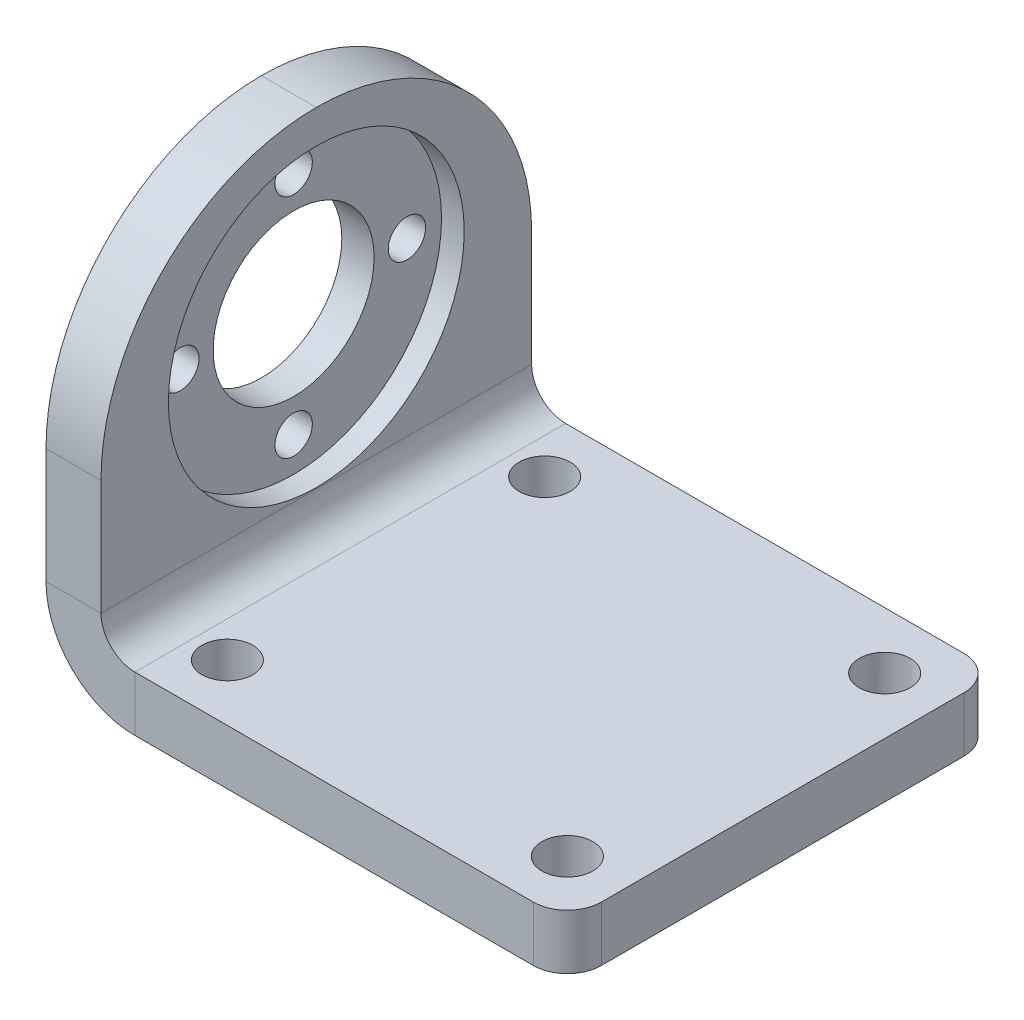
ISO-10303-21;
HEADER;
FILE_DESCRIPTION(('STEP AP214'),'2;1');
FILE_NAME('part.step','',(''),(''),'','','');
FILE_SCHEMA(('AUTOMOTIVE_DESIGN { 1 0 10303 214 1 1 1 1 }'));
ENDSEC;
DATA;
#1=APPLICATION_CONTEXT('core data for automotive mechanical design processes');
#2=APPLICATION_PROTOCOL_DEFINITION('international standard','automotive_design',2000,#1);
#3=PRODUCT_CONTEXT('',#1,'mechanical');
#4=PRODUCT('Part','Part','',(#3));
#5=PRODUCT_RELATED_PRODUCT_CATEGORY('part','',(#4));
#6=PRODUCT_DEFINITION_FORMATION('','',#4);
#7=PRODUCT_DEFINITION_CONTEXT('part definition',#1,'design');
#8=PRODUCT_DEFINITION('design','',#6,#7);
#9=PRODUCT_DEFINITION_SHAPE('','',#8);
#10=(LENGTH_UNIT() NAMED_UNIT(*) SI_UNIT(.MILLI.,.METRE.));
#11=(NAMED_UNIT(*) PLANE_ANGLE_UNIT() SI_UNIT($,.RADIAN.));
#12=(NAMED_UNIT(*) SI_UNIT($,.STERADIAN.) SOLID_ANGLE_UNIT());
#13=UNCERTAINTY_MEASURE_WITH_UNIT(LENGTH_MEASURE(1.E-05),#10,'distance_accuracy_value','');
#14=(GEOMETRIC_REPRESENTATION_CONTEXT(3) GLOBAL_UNCERTAINTY_ASSIGNED_CONTEXT((#13)) GLOBAL_UNIT_ASSIGNED_CONTEXT((#10,
#11,#12)) REPRESENTATION_CONTEXT('',''));
#15=CARTESIAN_POINT('',(0.,0.,0.));
#16=DIRECTION('',(0.,0.,1.));
#17=DIRECTION('',(1.,0.,0.));
#18=AXIS2_PLACEMENT_3D('',#15,#16,#17);
#19=CARTESIAN_POINT('',(0.,21.,19.));
#20=DIRECTION('',(1.,0.,0.));
#21=DIRECTION('',(0.,0.,-1.));
#22=AXIS2_PLACEMENT_3D('',#19,#20,#21);
#23=CYLINDRICAL_SURFACE('',#22,7.1);
#24=CARTESIAN_POINT('',(0.,21.,19.));
#25=DIRECTION('',(1.,0.,0.));
#26=DIRECTION('',(0.,0.,-1.));
#27=AXIS2_PLACEMENT_3D('',#24,#25,#26);
#28=CIRCLE('',#27,7.1);
#29=CARTESIAN_POINT('',(0.,21.,11.9));
#30=VERTEX_POINT('',#29);
#31=EDGE_CURVE('E174',#30,#30,#28,.T.);
#32=ORIENTED_EDGE('',*,*,#31,.F.);
#33=EDGE_LOOP('',(#32));
#34=FACE_BOUND('',#33,.T.);
#35=CARTESIAN_POINT('',(2.85,21.,19.));
#36=DIRECTION('',(1.,0.,0.));
#37=DIRECTION('',(0.,0.,-1.));
#38=AXIS2_PLACEMENT_3D('',#35,#36,#37);
#39=CIRCLE('',#38,7.1);
#40=CARTESIAN_POINT('',(2.85,21.,11.9));
#41=VERTEX_POINT('',#40);
#42=EDGE_CURVE('E202',#41,#41,#39,.F.);
#43=ORIENTED_EDGE('',*,*,#42,.F.);
#44=EDGE_LOOP('',(#43));
#45=FACE_BOUND('',#44,.T.);
#46=ADVANCED_FACE('F38',(#34,#45),#23,.F.);
#47=CARTESIAN_POINT('',(0.,7.85,38.));
#48=DIRECTION('',(0.,0.,1.));
#49=DIRECTION('',(1.,0.,0.));
#50=AXIS2_PLACEMENT_3D('',#47,#48,#49);
#51=PLANE('',#50);
#52=DIRECTION('',(1.,0.,0.));
#53=VECTOR('',#52,1.);
#54=CARTESIAN_POINT('',(0.,7.85,38.));
#55=LINE('',#54,#53);
#56=CARTESIAN_POINT('',(0.,7.85,38.));
#57=VERTEX_POINT('',#56);
#58=CARTESIAN_POINT('',(4.85,7.85,38.));
#59=VERTEX_POINT('',#58);
#60=EDGE_CURVE('E123',#57,#59,#55,.T.);
#61=ORIENTED_EDGE('',*,*,#60,.F.);
#62=CARTESIAN_POINT('',(7.85,7.85,38.));
#63=DIRECTION('',(0.,0.,1.));
#64=DIRECTION('',(1.,0.,0.));
#65=AXIS2_PLACEMENT_3D('',#62,#63,#64);
#66=CIRCLE('',#65,7.85);
#67=CARTESIAN_POINT('',(7.85,0.,38.));
#68=VERTEX_POINT('',#67);
#69=EDGE_CURVE('E128',#68,#57,#66,.F.);
#70=ORIENTED_EDGE('',*,*,#69,.F.);
#71=DIRECTION('',(0.,-1.,0.));
#72=VECTOR('',#71,1.);
#73=CARTESIAN_POINT('',(7.85,4.85,38.));
#74=LINE('',#73,#72);
#75=CARTESIAN_POINT('',(7.85,4.85,38.));
#76=VERTEX_POINT('',#75);
#77=EDGE_CURVE('E136',#76,#68,#74,.T.);
#78=ORIENTED_EDGE('',*,*,#77,.F.);
#79=CARTESIAN_POINT('',(7.85,7.85,38.));
#80=DIRECTION('',(0.,0.,1.));
#81=DIRECTION('',(1.,0.,0.));
#82=AXIS2_PLACEMENT_3D('',#79,#80,#81);
#83=CIRCLE('',#82,3.);
#84=EDGE_CURVE('E130',#76,#59,#83,.F.);
#85=ORIENTED_EDGE('',*,*,#84,.T.);
#86=EDGE_LOOP('',(#61,#70,#78,#85));
#87=FACE_BOUND('',#86,.T.);
#88=ADVANCED_FACE('F125',(#87),#51,.T.);
#89=CARTESIAN_POINT('',(7.85,4.85,38.));
#90=DIRECTION('',(0.,0.,1.));
#91=DIRECTION('',(1.,0.,0.));
#92=AXIS2_PLACEMENT_3D('',#89,#90,#91);
#93=PLANE('',#92);
#94=DIRECTION('',(0.,1.,0.));
#95=VECTOR('',#94,1.);
#96=CARTESIAN_POINT('',(4.85,0.,38.));
#97=LINE('',#96,#95);
#98=CARTESIAN_POINT('',(4.85,18.,38.));
#99=VERTEX_POINT('',#98);
#100=EDGE_CURVE('E157',#59,#99,#97,.T.);
#101=ORIENTED_EDGE('',*,*,#100,.T.);
#102=DIRECTION('',(1.,0.,0.));
#103=VECTOR('',#102,1.);
#104=CARTESIAN_POINT('',(7.85,18.,38.));
#105=LINE('',#104,#103);
#106=CARTESIAN_POINT('',(0.,18.,38.));
#107=VERTEX_POINT('',#106);
#108=EDGE_CURVE('E156',#99,#107,#105,.F.);
#109=ORIENTED_EDGE('',*,*,#108,.T.);
#110=DIRECTION('',(0.,1.,0.));
#111=VECTOR('',#110,1.);
#112=CARTESIAN_POINT('',(0.,0.,38.));
#113=LINE('',#112,#111);
#114=EDGE_CURVE('E144',#57,#107,#113,.T.);
#115=ORIENTED_EDGE('',*,*,#114,.F.);
#116=ORIENTED_EDGE('',*,*,#60,.T.);
#117=EDGE_LOOP('',(#101,#109,#115,#116));
#118=FACE_BOUND('',#117,.T.);
#119=ADVANCED_FACE('F154',(#118),#93,.T.);
#120=CARTESIAN_POINT('',(7.85,0.,0.));
#121=DIRECTION('',(0.,0.,-1.));
#122=DIRECTION('',(-1.,0.,0.));
#123=AXIS2_PLACEMENT_3D('',#120,#121,#122);
#124=PLANE('',#123);
#125=DIRECTION('',(0.,1.,0.));
#126=VECTOR('',#125,1.);
#127=CARTESIAN_POINT('',(7.85,0.,0.));
#128=LINE('',#127,#126);
#129=CARTESIAN_POINT('',(7.85,0.,0.));
#130=VERTEX_POINT('',#129);
#131=CARTESIAN_POINT('',(7.85,4.85,0.));
#132=VERTEX_POINT('',#131);
#133=EDGE_CURVE('E197',#130,#132,#128,.T.);
#134=ORIENTED_EDGE('',*,*,#133,.F.);
#135=CARTESIAN_POINT('',(7.85,7.85,0.));
#136=DIRECTION('',(0.,0.,1.));
#137=DIRECTION('',(1.,0.,0.));
#138=AXIS2_PLACEMENT_3D('',#135,#136,#137);
#139=CIRCLE('',#138,7.85);
#140=CARTESIAN_POINT('',(0.,7.85,0.));
#141=VERTEX_POINT('',#140);
#142=EDGE_CURVE('E176',#130,#141,#139,.F.);
#143=ORIENTED_EDGE('',*,*,#142,.T.);
#144=DIRECTION('',(-1.,0.,0.));
#145=VECTOR('',#144,1.);
#146=CARTESIAN_POINT('',(4.85,7.85,0.));
#147=LINE('',#146,#145);
#148=CARTESIAN_POINT('',(4.85,7.85,0.));
#149=VERTEX_POINT('',#148);
#150=EDGE_CURVE('E151',#149,#141,#147,.T.);
#151=ORIENTED_EDGE('',*,*,#150,.F.);
#152=CARTESIAN_POINT('',(7.85,7.85,0.));
#153=DIRECTION('',(0.,0.,1.));
#154=DIRECTION('',(1.,0.,0.));
#155=AXIS2_PLACEMENT_3D('',#152,#153,#154);
#156=CIRCLE('',#155,3.);
#157=EDGE_CURVE('E182',#132,#149,#156,.F.);
#158=ORIENTED_EDGE('',*,*,#157,.F.);
#159=EDGE_LOOP('',(#134,#143,#151,#158));
#160=FACE_BOUND('',#159,.T.);
#161=ADVANCED_FACE('F380',(#160),#124,.T.);
#162=CARTESIAN_POINT('',(4.85,7.85,0.));
#163=DIRECTION('',(0.,0.,-1.));
#164=DIRECTION('',(-1.,0.,0.));
#165=AXIS2_PLACEMENT_3D('',#162,#163,#164);
#166=PLANE('',#165);
#167=DIRECTION('',(1.,0.,0.));
#168=VECTOR('',#167,1.);
#169=CARTESIAN_POINT('',(0.,4.85,0.));
#170=LINE('',#169,#168);
#171=CARTESIAN_POINT('',(43.,4.85,0.));
#172=VERTEX_POINT('',#171);
#173=EDGE_CURVE('E180',#172,#132,#170,.F.);
#174=ORIENTED_EDGE('',*,*,#173,.F.);
#175=DIRECTION('',(0.,-1.,0.));
#176=VECTOR('',#175,1.);
#177=CARTESIAN_POINT('',(43.,7.85,0.));
#178=LINE('',#177,#176);
#179=CARTESIAN_POINT('',(43.,0.,0.));
#180=VERTEX_POINT('',#179);
#181=EDGE_CURVE('E11',#172,#180,#178,.T.);
#182=ORIENTED_EDGE('',*,*,#181,.T.);
#183=DIRECTION('',(-1.,0.,0.));
#184=VECTOR('',#183,1.);
#185=CARTESIAN_POINT('',(0.,0.,0.));
#186=LINE('',#185,#184);
#187=EDGE_CURVE('E178',#180,#130,#186,.T.);
#188=ORIENTED_EDGE('',*,*,#187,.T.);
#189=ORIENTED_EDGE('',*,*,#133,.T.);
#190=EDGE_LOOP('',(#174,#182,#188,#189));
#191=FACE_BOUND('',#190,.T.);
#192=ADVANCED_FACE('F376',(#191),#166,.T.);
#193=CARTESIAN_POINT('',(4.85,0.,38.));
#194=DIRECTION('',(-1.,0.,0.));
#195=DIRECTION('',(0.,0.,1.));
#196=AXIS2_PLACEMENT_3D('',#193,#194,#195);
#197=PLANE('',#196);
#198=CARTESIAN_POINT('',(4.85,21.,19.));
#199=DIRECTION('',(1.,0.,0.));
#200=DIRECTION('',(0.,0.,-1.));
#201=AXIS2_PLACEMENT_3D('',#198,#199,#200);
#202=CIRCLE('',#201,13.05);
#203=CARTESIAN_POINT('',(4.85,21.,5.94999999999999));
#204=VERTEX_POINT('',#203);
#205=EDGE_CURVE('E221',#204,#204,#202,.T.);
#206=ORIENTED_EDGE('',*,*,#205,.F.);
#207=EDGE_LOOP('',(#206));
#208=FACE_BOUND('',#207,.T.);
#209=DIRECTION('',(0.,1.,0.));
#210=VECTOR('',#209,1.);
#211=CARTESIAN_POINT('',(4.85,0.,0.));
#212=LINE('',#211,#210);
#213=CARTESIAN_POINT('',(4.85,18.,0.));
#214=VERTEX_POINT('',#213);
#215=EDGE_CURVE('E171',#149,#214,#212,.T.);
#216=ORIENTED_EDGE('',*,*,#215,.T.);
#217=CARTESIAN_POINT('',(4.85,18.,19.));
#218=DIRECTION('',(-1.,0.,0.));
#219=DIRECTION('',(0.,0.,1.));
#220=AXIS2_PLACEMENT_3D('',#217,#218,#219);
#221=CIRCLE('',#220,19.);
#222=CARTESIAN_POINT('',(4.85,37.,19.));
#223=VERTEX_POINT('',#222);
#224=EDGE_CURVE('E210',#214,#223,#221,.F.);
#225=ORIENTED_EDGE('',*,*,#224,.T.);
#226=CARTESIAN_POINT('',(4.85,18.,19.));
#227=DIRECTION('',(-1.,0.,0.));
#228=DIRECTION('',(0.,0.,1.));
#229=AXIS2_PLACEMENT_3D('',#226,#227,#228);
#230=CIRCLE('',#229,19.);
#231=EDGE_CURVE('E208',#223,#99,#230,.F.);
#232=ORIENTED_EDGE('',*,*,#231,.T.);
#233=ORIENTED_EDGE('',*,*,#100,.F.);
#234=DIRECTION('',(0.,0.,-1.));
#235=VECTOR('',#234,1.);
#236=CARTESIAN_POINT('',(4.85,7.85,38.));
#237=LINE('',#236,#235);
#238=EDGE_CURVE('E170',#59,#149,#237,.T.);
#239=ORIENTED_EDGE('',*,*,#238,.T.);
#240=EDGE_LOOP('',(#216,#225,#232,#233,#239));
#241=FACE_BOUND('',#240,.T.);
#242=ADVANCED_FACE('F280',(#208,#241),#197,.F.);
#243=CARTESIAN_POINT('',(0.,0.,38.));
#244=DIRECTION('',(-1.,0.,0.));
#245=DIRECTION('',(0.,0.,1.));
#246=AXIS2_PLACEMENT_3D('',#243,#244,#245);
#247=PLANE('',#246);
#248=CARTESIAN_POINT('',(0.,31.,19.));
#249=DIRECTION('',(1.,0.,0.));
#250=DIRECTION('',(0.,0.,-1.));
#251=AXIS2_PLACEMENT_3D('',#248,#249,#250);
#252=CIRCLE('',#251,1.65);
#253=CARTESIAN_POINT('',(0.,31.,17.35));
#254=VERTEX_POINT('',#253);
#255=EDGE_CURVE('E230',#254,#254,#252,.T.);
#256=ORIENTED_EDGE('',*,*,#255,.T.);
#257=EDGE_LOOP('',(#256));
#258=FACE_BOUND('',#257,.T.);
#259=CARTESIAN_POINT('',(0.,11.,19.));
#260=DIRECTION('',(1.,0.,0.));
#261=DIRECTION('',(0.,0.,-1.));
#262=AXIS2_PLACEMENT_3D('',#259,#260,#261);
#263=CIRCLE('',#262,1.65);
#264=CARTESIAN_POINT('',(0.,11.,17.35));
#265=VERTEX_POINT('',#264);
#266=EDGE_CURVE('E293',#265,#265,#263,.T.);
#267=ORIENTED_EDGE('',*,*,#266,.T.);
#268=EDGE_LOOP('',(#267));
#269=FACE_BOUND('',#268,.T.);
#270=CARTESIAN_POINT('',(0.,21.,29.));
#271=DIRECTION('',(1.,0.,0.));
#272=DIRECTION('',(0.,0.,-1.));
#273=AXIS2_PLACEMENT_3D('',#270,#271,#272);
#274=CIRCLE('',#273,1.65);
#275=CARTESIAN_POINT('',(0.,21.,27.35));
#276=VERTEX_POINT('',#275);
#277=EDGE_CURVE('E239',#276,#276,#274,.T.);
#278=ORIENTED_EDGE('',*,*,#277,.T.);
#279=EDGE_LOOP('',(#278));
#280=FACE_BOUND('',#279,.T.);
#281=CARTESIAN_POINT('',(0.,21.,9.));
#282=DIRECTION('',(1.,0.,0.));
#283=DIRECTION('',(0.,0.,-1.));
#284=AXIS2_PLACEMENT_3D('',#281,#282,#283);
#285=CIRCLE('',#284,1.65);
#286=CARTESIAN_POINT('',(0.,21.,7.35));
#287=VERTEX_POINT('',#286);
#288=EDGE_CURVE('E225',#287,#287,#285,.T.);
#289=ORIENTED_EDGE('',*,*,#288,.T.);
#290=EDGE_LOOP('',(#289));
#291=FACE_BOUND('',#290,.T.);
#292=ORIENTED_EDGE('',*,*,#31,.T.);
#293=EDGE_LOOP('',(#292));
#294=FACE_BOUND('',#293,.T.);
#295=CARTESIAN_POINT('',(0.,18.,19.));
#296=DIRECTION('',(-1.,0.,0.));
#297=DIRECTION('',(0.,0.,1.));
#298=AXIS2_PLACEMENT_3D('',#295,#296,#297);
#299=CIRCLE('',#298,19.);
#300=CARTESIAN_POINT('',(0.,37.,19.));
#301=VERTEX_POINT('',#300);
#302=EDGE_CURVE('E212',#107,#301,#299,.T.);
#303=ORIENTED_EDGE('',*,*,#302,.T.);
#304=CARTESIAN_POINT('',(0.,18.,19.));
#305=DIRECTION('',(-1.,0.,0.));
#306=DIRECTION('',(0.,0.,1.));
#307=AXIS2_PLACEMENT_3D('',#304,#305,#306);
#308=CIRCLE('',#307,19.);
#309=CARTESIAN_POINT('',(0.,18.,0.));
#310=VERTEX_POINT('',#309);
#311=EDGE_CURVE('E214',#301,#310,#308,.T.);
#312=ORIENTED_EDGE('',*,*,#311,.T.);
#313=DIRECTION('',(0.,1.,0.));
#314=VECTOR('',#313,1.);
#315=CARTESIAN_POINT('',(0.,0.,0.));
#316=LINE('',#315,#314);
#317=EDGE_CURVE('E147',#141,#310,#316,.T.);
#318=ORIENTED_EDGE('',*,*,#317,.F.);
#319=DIRECTION('',(0.,0.,-1.));
#320=VECTOR('',#319,1.);
#321=CARTESIAN_POINT('',(0.,7.85,38.));
#322=LINE('',#321,#320);
#323=EDGE_CURVE('E142',#57,#141,#322,.T.);
#324=ORIENTED_EDGE('',*,*,#323,.F.);
#325=ORIENTED_EDGE('',*,*,#114,.T.);
#326=EDGE_LOOP('',(#303,#312,#318,#324,#325));
#327=FACE_BOUND('',#326,.T.);
#328=ADVANCED_FACE('F143',(#258,#269,#280,#291,#294,#327),#247,.T.);
#329=CARTESIAN_POINT('',(7.85,7.85,38.));
#330=DIRECTION('',(0.,0.,-1.));
#331=DIRECTION('',(-1.,0.,0.));
#332=AXIS2_PLACEMENT_3D('',#329,#330,#331);
#333=CYLINDRICAL_SURFACE('',#332,7.85);
#334=ORIENTED_EDGE('',*,*,#142,.F.);
#335=DIRECTION('',(0.,0.,-1.));
#336=VECTOR('',#335,1.);
#337=CARTESIAN_POINT('',(7.85,0.,38.));
#338=LINE('',#337,#336);
#339=EDGE_CURVE('E152',#68,#130,#338,.T.);
#340=ORIENTED_EDGE('',*,*,#339,.F.);
#341=ORIENTED_EDGE('',*,*,#69,.T.);
#342=ORIENTED_EDGE('',*,*,#323,.T.);
#343=EDGE_LOOP('',(#334,#340,#341,#342));
#344=FACE_BOUND('',#343,.T.);
#345=ADVANCED_FACE('F160',(#344),#333,.T.);
#346=CARTESIAN_POINT('',(0.,0.,38.));
#347=DIRECTION('',(0.,-1.,0.));
#348=DIRECTION('',(0.,0.,-1.));
#349=AXIS2_PLACEMENT_3D('',#346,#347,#348);
#350=PLANE('',#349);
#351=CARTESIAN_POINT('',(11.,0.,5.));
#352=DIRECTION('',(0.,1.,0.));
#353=DIRECTION('',(0.,0.,-1.));
#354=AXIS2_PLACEMENT_3D('',#351,#352,#353);
#355=CIRCLE('',#354,2.25);
#356=CARTESIAN_POINT('',(11.,0.,2.75));
#357=VERTEX_POINT('',#356);
#358=EDGE_CURVE('E245',#357,#357,#355,.T.);
#359=ORIENTED_EDGE('',*,*,#358,.T.);
#360=EDGE_LOOP('',(#359));
#361=FACE_BOUND('',#360,.T.);
#362=CARTESIAN_POINT('',(11.,0.,33.));
#363=DIRECTION('',(0.,1.,0.));
#364=DIRECTION('',(0.,0.,1.));
#365=AXIS2_PLACEMENT_3D('',#362,#363,#364);
#366=CIRCLE('',#365,2.25);
#367=CARTESIAN_POINT('',(11.,0.,35.25));
#368=VERTEX_POINT('',#367);
#369=EDGE_CURVE('E303',#368,#368,#366,.T.);
#370=ORIENTED_EDGE('',*,*,#369,.T.);
#371=EDGE_LOOP('',(#370));
#372=FACE_BOUND('',#371,.T.);
#373=CARTESIAN_POINT('',(41.,0.,33.));
#374=DIRECTION('',(0.,1.,0.));
#375=DIRECTION('',(0.,0.,-1.));
#376=AXIS2_PLACEMENT_3D('',#373,#374,#375);
#377=CIRCLE('',#376,2.25);
#378=CARTESIAN_POINT('',(41.,0.,30.75));
#379=VERTEX_POINT('',#378);
#380=EDGE_CURVE('E300',#379,#379,#377,.T.);
#381=ORIENTED_EDGE('',*,*,#380,.T.);
#382=EDGE_LOOP('',(#381));
#383=FACE_BOUND('',#382,.T.);
#384=CARTESIAN_POINT('',(41.,0.,5.));
#385=DIRECTION('',(0.,1.,0.));
#386=DIRECTION('',(0.,0.,1.));
#387=AXIS2_PLACEMENT_3D('',#384,#385,#386);
#388=CIRCLE('',#387,2.25);
#389=CARTESIAN_POINT('',(41.,0.,7.25));
#390=VERTEX_POINT('',#389);
#391=EDGE_CURVE('E240',#390,#390,#388,.T.);
#392=ORIENTED_EDGE('',*,*,#391,.T.);
#393=EDGE_LOOP('',(#392));
#394=FACE_BOUND('',#393,.T.);
#395=DIRECTION('',(0.,0.,-1.));
#396=VECTOR('',#395,1.);
#397=CARTESIAN_POINT('',(46.,0.,38.));
#398=LINE('',#397,#396);
#399=CARTESIAN_POINT('',(46.,0.,35.));
#400=VERTEX_POINT('',#399);
#401=CARTESIAN_POINT('',(46.,0.,3.));
#402=VERTEX_POINT('',#401);
#403=EDGE_CURVE('E192',#400,#402,#398,.T.);
#404=ORIENTED_EDGE('',*,*,#403,.F.);
#405=CARTESIAN_POINT('',(43.,0.,35.));
#406=DIRECTION('',(0.,-1.,0.));
#407=DIRECTION('',(0.,0.,-1.));
#408=AXIS2_PLACEMENT_3D('',#405,#406,#407);
#409=CIRCLE('',#408,3.);
#410=CARTESIAN_POINT('',(43.,0.,38.));
#411=VERTEX_POINT('',#410);
#412=EDGE_CURVE('E257',#400,#411,#409,.T.);
#413=ORIENTED_EDGE('',*,*,#412,.T.);
#414=DIRECTION('',(-1.,0.,0.));
#415=VECTOR('',#414,1.);
#416=CARTESIAN_POINT('',(0.,0.,38.));
#417=LINE('',#416,#415);
#418=EDGE_CURVE('E162',#411,#68,#417,.T.);
#419=ORIENTED_EDGE('',*,*,#418,.T.);
#420=ORIENTED_EDGE('',*,*,#339,.T.);
#421=ORIENTED_EDGE('',*,*,#187,.F.);
#422=CARTESIAN_POINT('',(43.,0.,3.));
#423=DIRECTION('',(0.,-1.,0.));
#424=DIRECTION('',(0.,0.,-1.));
#425=AXIS2_PLACEMENT_3D('',#422,#423,#424);
#426=CIRCLE('',#425,3.);
#427=EDGE_CURVE('E255',#180,#402,#426,.T.);
#428=ORIENTED_EDGE('',*,*,#427,.T.);
#429=EDGE_LOOP('',(#404,#413,#419,#420,#421,#428));
#430=FACE_BOUND('',#429,.T.);
#431=ADVANCED_FACE('F272',(#361,#372,#383,#394,#430),#350,.T.);
#432=CARTESIAN_POINT('',(46.,4.85,38.));
#433=DIRECTION('',(1.,0.,0.));
#434=DIRECTION('',(0.,0.,-1.));
#435=AXIS2_PLACEMENT_3D('',#432,#433,#434);
#436=PLANE('',#435);
#437=DIRECTION('',(0.,0.,-1.));
#438=VECTOR('',#437,1.);
#439=CARTESIAN_POINT('',(46.,4.85,38.));
#440=LINE('',#439,#438);
#441=CARTESIAN_POINT('',(46.,4.85,35.));
#442=VERTEX_POINT('',#441);
#443=CARTESIAN_POINT('',(46.,4.85,3.));
#444=VERTEX_POINT('',#443);
#445=EDGE_CURVE('E190',#442,#444,#440,.T.);
#446=ORIENTED_EDGE('',*,*,#445,.F.);
#447=DIRECTION('',(0.,-1.,0.));
#448=VECTOR('',#447,1.);
#449=CARTESIAN_POINT('',(46.,4.85,35.));
#450=LINE('',#449,#448);
#451=EDGE_CURVE('E252',#442,#400,#450,.T.);
#452=ORIENTED_EDGE('',*,*,#451,.T.);
#453=ORIENTED_EDGE('',*,*,#403,.T.);
#454=DIRECTION('',(0.,-1.,0.));
#455=VECTOR('',#454,1.);
#456=CARTESIAN_POINT('',(46.,4.85,3.));
#457=LINE('',#456,#455);
#458=EDGE_CURVE('E217',#402,#444,#457,.F.);
#459=ORIENTED_EDGE('',*,*,#458,.T.);
#460=EDGE_LOOP('',(#446,#452,#453,#459));
#461=FACE_BOUND('',#460,.T.);
#462=ADVANCED_FACE('F267',(#461),#436,.T.);
#463=CARTESIAN_POINT('',(0.,4.85,38.));
#464=DIRECTION('',(0.,-1.,0.));
#465=DIRECTION('',(0.,0.,-1.));
#466=AXIS2_PLACEMENT_3D('',#463,#464,#465);
#467=PLANE('',#466);
#468=CARTESIAN_POINT('',(11.,4.85,5.));
#469=DIRECTION('',(0.,-1.,0.));
#470=DIRECTION('',(0.,0.,-1.));
#471=AXIS2_PLACEMENT_3D('',#468,#469,#470);
#472=CIRCLE('',#471,2.25);
#473=CARTESIAN_POINT('',(11.,4.85,2.75));
#474=VERTEX_POINT('',#473);
#475=EDGE_CURVE('E248',#474,#474,#472,.T.);
#476=ORIENTED_EDGE('',*,*,#475,.T.);
#477=EDGE_LOOP('',(#476));
#478=FACE_BOUND('',#477,.T.);
#479=CARTESIAN_POINT('',(11.,4.85,33.));
#480=DIRECTION('',(0.,-1.,0.));
#481=DIRECTION('',(0.,0.,-1.));
#482=AXIS2_PLACEMENT_3D('',#479,#480,#481);
#483=CIRCLE('',#482,2.25);
#484=CARTESIAN_POINT('',(11.,4.85,30.75));
#485=VERTEX_POINT('',#484);
#486=EDGE_CURVE('E244',#485,#485,#483,.T.);
#487=ORIENTED_EDGE('',*,*,#486,.T.);
#488=EDGE_LOOP('',(#487));
#489=FACE_BOUND('',#488,.T.);
#490=CARTESIAN_POINT('',(41.,4.85,33.));
#491=DIRECTION('',(0.,-1.,0.));
#492=DIRECTION('',(0.,0.,-1.));
#493=AXIS2_PLACEMENT_3D('',#490,#491,#492);
#494=CIRCLE('',#493,2.25);
#495=CARTESIAN_POINT('',(41.,4.85,30.75));
#496=VERTEX_POINT('',#495);
#497=EDGE_CURVE('E241',#496,#496,#494,.T.);
#498=ORIENTED_EDGE('',*,*,#497,.T.);
#499=EDGE_LOOP('',(#498));
#500=FACE_BOUND('',#499,.T.);
#501=CARTESIAN_POINT('',(41.,4.85,5.));
#502=DIRECTION('',(0.,-1.,0.));
#503=DIRECTION('',(0.,0.,-1.));
#504=AXIS2_PLACEMENT_3D('',#501,#502,#503);
#505=CIRCLE('',#504,2.25);
#506=CARTESIAN_POINT('',(41.,4.85,2.75));
#507=VERTEX_POINT('',#506);
#508=EDGE_CURVE('E236',#507,#507,#505,.T.);
#509=ORIENTED_EDGE('',*,*,#508,.T.);
#510=EDGE_LOOP('',(#509));
#511=FACE_BOUND('',#510,.T.);
#512=DIRECTION('',(1.,0.,0.));
#513=VECTOR('',#512,1.);
#514=CARTESIAN_POINT('',(0.,4.85,38.));
#515=LINE('',#514,#513);
#516=CARTESIAN_POINT('',(43.,4.85,38.));
#517=VERTEX_POINT('',#516);
#518=EDGE_CURVE('E164',#517,#76,#515,.F.);
#519=ORIENTED_EDGE('',*,*,#518,.F.);
#520=CARTESIAN_POINT('',(43.,4.85,35.));
#521=DIRECTION('',(0.,-1.,0.));
#522=DIRECTION('',(0.,0.,-1.));
#523=AXIS2_PLACEMENT_3D('',#520,#521,#522);
#524=CIRCLE('',#523,3.);
#525=EDGE_CURVE('E46',#517,#442,#524,.F.);
#526=ORIENTED_EDGE('',*,*,#525,.T.);
#527=ORIENTED_EDGE('',*,*,#445,.T.);
#528=CARTESIAN_POINT('',(43.,4.85,3.));
#529=DIRECTION('',(0.,-1.,0.));
#530=DIRECTION('',(0.,0.,-1.));
#531=AXIS2_PLACEMENT_3D('',#528,#529,#530);
#532=CIRCLE('',#531,3.);
#533=EDGE_CURVE('E53',#444,#172,#532,.F.);
#534=ORIENTED_EDGE('',*,*,#533,.T.);
#535=ORIENTED_EDGE('',*,*,#173,.T.);
#536=DIRECTION('',(0.,0.,-1.));
#537=VECTOR('',#536,1.);
#538=CARTESIAN_POINT('',(7.85,4.85,38.));
#539=LINE('',#538,#537);
#540=EDGE_CURVE('E187',#76,#132,#539,.T.);
#541=ORIENTED_EDGE('',*,*,#540,.F.);
#542=EDGE_LOOP('',(#519,#526,#527,#534,#535,#541));
#543=FACE_BOUND('',#542,.T.);
#544=ADVANCED_FACE('F262',(#478,#489,#500,#511,#543),#467,.F.);
#545=CARTESIAN_POINT('',(7.85,7.85,38.));
#546=DIRECTION('',(0.,0.,-1.));
#547=DIRECTION('',(-1.,0.,0.));
#548=AXIS2_PLACEMENT_3D('',#545,#546,#547);
#549=CYLINDRICAL_SURFACE('',#548,3.);
#550=ORIENTED_EDGE('',*,*,#157,.T.);
#551=ORIENTED_EDGE('',*,*,#238,.F.);
#552=ORIENTED_EDGE('',*,*,#84,.F.);
#553=ORIENTED_EDGE('',*,*,#540,.T.);
#554=EDGE_LOOP('',(#550,#551,#552,#553));
#555=FACE_BOUND('',#554,.T.);
#556=ADVANCED_FACE('F276',(#555),#549,.F.);
#557=CARTESIAN_POINT('',(7.85,7.85,38.));
#558=DIRECTION('',(0.,0.,1.));
#559=DIRECTION('',(1.,0.,0.));
#560=AXIS2_PLACEMENT_3D('',#557,#558,#559);
#561=PLANE('',#560);
#562=ORIENTED_EDGE('',*,*,#418,.F.);
#563=DIRECTION('',(0.,-1.,0.));
#564=VECTOR('',#563,1.);
#565=CARTESIAN_POINT('',(43.,7.85,38.));
#566=LINE('',#565,#564);
#567=EDGE_CURVE('E61',#411,#517,#566,.F.);
#568=ORIENTED_EDGE('',*,*,#567,.T.);
#569=ORIENTED_EDGE('',*,*,#518,.T.);
#570=ORIENTED_EDGE('',*,*,#77,.T.);
#571=EDGE_LOOP('',(#562,#568,#569,#570));
#572=FACE_BOUND('',#571,.T.);
#573=ADVANCED_FACE('F273',(#572),#561,.T.);
#574=CARTESIAN_POINT('',(7.85,7.85,0.));
#575=DIRECTION('',(0.,0.,1.));
#576=DIRECTION('',(1.,0.,0.));
#577=AXIS2_PLACEMENT_3D('',#574,#575,#576);
#578=PLANE('',#577);
#579=ORIENTED_EDGE('',*,*,#317,.T.);
#580=DIRECTION('',(1.,0.,0.));
#581=VECTOR('',#580,1.);
#582=CARTESIAN_POINT('',(4.85,18.,0.));
#583=LINE('',#582,#581);
#584=EDGE_CURVE('E135',#310,#214,#583,.T.);
#585=ORIENTED_EDGE('',*,*,#584,.T.);
#586=ORIENTED_EDGE('',*,*,#215,.F.);
#587=ORIENTED_EDGE('',*,*,#150,.T.);
#588=EDGE_LOOP('',(#579,#585,#586,#587));
#589=FACE_BOUND('',#588,.T.);
#590=ADVANCED_FACE('F358',(#589),#578,.F.);
#591=CARTESIAN_POINT('',(2.85,21.,19.));
#592=DIRECTION('',(1.,0.,0.));
#593=DIRECTION('',(0.,0.,-1.));
#594=AXIS2_PLACEMENT_3D('',#591,#592,#593);
#595=PLANE('',#594);
#596=CARTESIAN_POINT('',(2.85,31.,19.));
#597=DIRECTION('',(1.,0.,0.));
#598=DIRECTION('',(0.,0.,-1.));
#599=AXIS2_PLACEMENT_3D('',#596,#597,#598);
#600=CIRCLE('',#599,1.65);
#601=CARTESIAN_POINT('',(2.85,31.,17.35));
#602=VERTEX_POINT('',#601);
#603=EDGE_CURVE('E233',#602,#602,#600,.T.);
#604=ORIENTED_EDGE('',*,*,#603,.F.);
#605=EDGE_LOOP('',(#604));
#606=FACE_BOUND('',#605,.T.);
#607=CARTESIAN_POINT('',(2.85,11.,19.));
#608=DIRECTION('',(1.,0.,0.));
#609=DIRECTION('',(0.,0.,-1.));
#610=AXIS2_PLACEMENT_3D('',#607,#608,#609);
#611=CIRCLE('',#610,1.65);
#612=CARTESIAN_POINT('',(2.85,11.,17.35));
#613=VERTEX_POINT('',#612);
#614=EDGE_CURVE('E229',#613,#613,#611,.T.);
#615=ORIENTED_EDGE('',*,*,#614,.F.);
#616=EDGE_LOOP('',(#615));
#617=FACE_BOUND('',#616,.T.);
#618=CARTESIAN_POINT('',(2.85,21.,29.));
#619=DIRECTION('',(1.,0.,0.));
#620=DIRECTION('',(0.,0.,-1.));
#621=AXIS2_PLACEMENT_3D('',#618,#619,#620);
#622=CIRCLE('',#621,1.65);
#623=CARTESIAN_POINT('',(2.85,21.,27.35));
#624=VERTEX_POINT('',#623);
#625=EDGE_CURVE('E226',#624,#624,#622,.T.);
#626=ORIENTED_EDGE('',*,*,#625,.F.);
#627=EDGE_LOOP('',(#626));
#628=FACE_BOUND('',#627,.T.);
#629=CARTESIAN_POINT('',(2.85,21.,9.));
#630=DIRECTION('',(1.,0.,0.));
#631=DIRECTION('',(0.,0.,-1.));
#632=AXIS2_PLACEMENT_3D('',#629,#630,#631);
#633=CIRCLE('',#632,1.65);
#634=CARTESIAN_POINT('',(2.85,21.,7.35));
#635=VERTEX_POINT('',#634);
#636=EDGE_CURVE('E222',#635,#635,#633,.T.);
#637=ORIENTED_EDGE('',*,*,#636,.F.);
#638=EDGE_LOOP('',(#637));
#639=FACE_BOUND('',#638,.T.);
#640=CARTESIAN_POINT('',(2.85,21.,19.));
#641=DIRECTION('',(1.,0.,0.));
#642=DIRECTION('',(0.,0.,-1.));
#643=AXIS2_PLACEMENT_3D('',#640,#641,#642);
#644=CIRCLE('',#643,13.05);
#645=CARTESIAN_POINT('',(2.85,21.,5.94999999999999));
#646=VERTEX_POINT('',#645);
#647=EDGE_CURVE('E205',#646,#646,#644,.T.);
#648=ORIENTED_EDGE('',*,*,#647,.T.);
#649=EDGE_LOOP('',(#648));
#650=FACE_BOUND('',#649,.T.);
#651=ORIENTED_EDGE('',*,*,#42,.T.);
#652=EDGE_LOOP('',(#651));
#653=FACE_BOUND('',#652,.T.);
#654=ADVANCED_FACE('F361',(#606,#617,#628,#639,#650,#653),#595,.T.);
#655=CARTESIAN_POINT('',(2.85,21.,19.));
#656=DIRECTION('',(1.,0.,0.));
#657=DIRECTION('',(0.,0.,-1.));
#658=AXIS2_PLACEMENT_3D('',#655,#656,#657);
#659=CYLINDRICAL_SURFACE('',#658,13.05);
#660=ORIENTED_EDGE('',*,*,#647,.F.);
#661=EDGE_LOOP('',(#660));
#662=FACE_BOUND('',#661,.T.);
#663=ORIENTED_EDGE('',*,*,#205,.T.);
#664=EDGE_LOOP('',(#663));
#665=FACE_BOUND('',#664,.T.);
#666=ADVANCED_FACE('F354',(#662,#665),#659,.F.);
#667=CARTESIAN_POINT('',(0.,18.,19.));
#668=DIRECTION('',(1.,0.,0.));
#669=DIRECTION('',(0.,0.,-1.));
#670=AXIS2_PLACEMENT_3D('',#667,#668,#669);
#671=CYLINDRICAL_SURFACE('',#670,19.);
#672=DIRECTION('',(1.,0.,0.));
#673=VECTOR('',#672,1.);
#674=CARTESIAN_POINT('',(0.,37.,19.));
#675=LINE('',#674,#673);
#676=EDGE_CURVE('E218',#301,#223,#675,.T.);
#677=ORIENTED_EDGE('',*,*,#676,.F.);
#678=ORIENTED_EDGE('',*,*,#302,.F.);
#679=ORIENTED_EDGE('',*,*,#108,.F.);
#680=ORIENTED_EDGE('',*,*,#231,.F.);
#681=EDGE_LOOP('',(#677,#678,#679,#680));
#682=FACE_BOUND('',#681,.T.);
#683=ADVANCED_FACE('F391',(#682),#671,.T.);
#684=CARTESIAN_POINT('',(7.85,18.,19.));
#685=DIRECTION('',(-1.,0.,0.));
#686=DIRECTION('',(0.,0.,1.));
#687=AXIS2_PLACEMENT_3D('',#684,#685,#686);
#688=CYLINDRICAL_SURFACE('',#687,19.);
#689=ORIENTED_EDGE('',*,*,#311,.F.);
#690=ORIENTED_EDGE('',*,*,#676,.T.);
#691=ORIENTED_EDGE('',*,*,#224,.F.);
#692=ORIENTED_EDGE('',*,*,#584,.F.);
#693=EDGE_LOOP('',(#689,#690,#691,#692));
#694=FACE_BOUND('',#693,.T.);
#695=ADVANCED_FACE('F387',(#694),#688,.T.);
#696=CARTESIAN_POINT('',(0.,21.,9.));
#697=DIRECTION('',(1.,0.,0.));
#698=DIRECTION('',(0.,0.,-1.));
#699=AXIS2_PLACEMENT_3D('',#696,#697,#698);
#700=CYLINDRICAL_SURFACE('',#699,1.65);
#701=ORIENTED_EDGE('',*,*,#636,.T.);
#702=EDGE_LOOP('',(#701));
#703=FACE_BOUND('',#702,.T.);
#704=ORIENTED_EDGE('',*,*,#288,.F.);
#705=EDGE_LOOP('',(#704));
#706=FACE_BOUND('',#705,.T.);
#707=ADVANCED_FACE('F390',(#703,#706),#700,.F.);
#708=CARTESIAN_POINT('',(0.,21.,29.));
#709=DIRECTION('',(1.,0.,0.));
#710=DIRECTION('',(0.,0.,-1.));
#711=AXIS2_PLACEMENT_3D('',#708,#709,#710);
#712=CYLINDRICAL_SURFACE('',#711,1.65);
#713=ORIENTED_EDGE('',*,*,#625,.T.);
#714=EDGE_LOOP('',(#713));
#715=FACE_BOUND('',#714,.T.);
#716=ORIENTED_EDGE('',*,*,#277,.F.);
#717=EDGE_LOOP('',(#716));
#718=FACE_BOUND('',#717,.T.);
#719=ADVANCED_FACE('F492',(#715,#718),#712,.F.);
#720=CARTESIAN_POINT('',(0.,11.,19.));
#721=DIRECTION('',(1.,0.,0.));
#722=DIRECTION('',(0.,0.,-1.));
#723=AXIS2_PLACEMENT_3D('',#720,#721,#722);
#724=CYLINDRICAL_SURFACE('',#723,1.65);
#725=ORIENTED_EDGE('',*,*,#614,.T.);
#726=EDGE_LOOP('',(#725));
#727=FACE_BOUND('',#726,.T.);
#728=ORIENTED_EDGE('',*,*,#266,.F.);
#729=EDGE_LOOP('',(#728));
#730=FACE_BOUND('',#729,.T.);
#731=ADVANCED_FACE('F339',(#727,#730),#724,.F.);
#732=CARTESIAN_POINT('',(0.,31.,19.));
#733=DIRECTION('',(1.,0.,0.));
#734=DIRECTION('',(0.,0.,-1.));
#735=AXIS2_PLACEMENT_3D('',#732,#733,#734);
#736=CYLINDRICAL_SURFACE('',#735,1.65);
#737=ORIENTED_EDGE('',*,*,#603,.T.);
#738=EDGE_LOOP('',(#737));
#739=FACE_BOUND('',#738,.T.);
#740=ORIENTED_EDGE('',*,*,#255,.F.);
#741=EDGE_LOOP('',(#740));
#742=FACE_BOUND('',#741,.T.);
#743=ADVANCED_FACE('F330',(#739,#742),#736,.F.);
#744=CARTESIAN_POINT('',(41.,0.,5.));
#745=DIRECTION('',(0.,1.,0.));
#746=DIRECTION('',(0.,0.,1.));
#747=AXIS2_PLACEMENT_3D('',#744,#745,#746);
#748=CYLINDRICAL_SURFACE('',#747,2.25);
#749=ORIENTED_EDGE('',*,*,#391,.F.);
#750=EDGE_LOOP('',(#749));
#751=FACE_BOUND('',#750,.T.);
#752=ORIENTED_EDGE('',*,*,#508,.F.);
#753=EDGE_LOOP('',(#752));
#754=FACE_BOUND('',#753,.T.);
#755=ADVANCED_FACE('F327',(#751,#754),#748,.F.);
#756=CARTESIAN_POINT('',(41.,0.,33.));
#757=DIRECTION('',(0.,1.,0.));
#758=DIRECTION('',(0.,0.,1.));
#759=AXIS2_PLACEMENT_3D('',#756,#757,#758);
#760=CYLINDRICAL_SURFACE('',#759,2.25);
#761=ORIENTED_EDGE('',*,*,#380,.F.);
#762=EDGE_LOOP('',(#761));
#763=FACE_BOUND('',#762,.T.);
#764=ORIENTED_EDGE('',*,*,#497,.F.);
#765=EDGE_LOOP('',(#764));
#766=FACE_BOUND('',#765,.T.);
#767=ADVANCED_FACE('F329',(#763,#766),#760,.F.);
#768=CARTESIAN_POINT('',(11.,0.,33.));
#769=DIRECTION('',(0.,1.,0.));
#770=DIRECTION('',(0.,0.,1.));
#771=AXIS2_PLACEMENT_3D('',#768,#769,#770);
#772=CYLINDRICAL_SURFACE('',#771,2.25);
#773=ORIENTED_EDGE('',*,*,#369,.F.);
#774=EDGE_LOOP('',(#773));
#775=FACE_BOUND('',#774,.T.);
#776=ORIENTED_EDGE('',*,*,#486,.F.);
#777=EDGE_LOOP('',(#776));
#778=FACE_BOUND('',#777,.T.);
#779=ADVANCED_FACE('F314',(#775,#778),#772,.F.);
#780=CARTESIAN_POINT('',(11.,0.,5.));
#781=DIRECTION('',(0.,1.,0.));
#782=DIRECTION('',(0.,0.,1.));
#783=AXIS2_PLACEMENT_3D('',#780,#781,#782);
#784=CYLINDRICAL_SURFACE('',#783,2.25);
#785=ORIENTED_EDGE('',*,*,#358,.F.);
#786=EDGE_LOOP('',(#785));
#787=FACE_BOUND('',#786,.T.);
#788=ORIENTED_EDGE('',*,*,#475,.F.);
#789=EDGE_LOOP('',(#788));
#790=FACE_BOUND('',#789,.T.);
#791=ADVANCED_FACE('F311',(#787,#790),#784,.F.);
#792=CARTESIAN_POINT('',(43.,4.85,35.));
#793=DIRECTION('',(0.,-1.,0.));
#794=DIRECTION('',(0.,0.,-1.));
#795=AXIS2_PLACEMENT_3D('',#792,#793,#794);
#796=CYLINDRICAL_SURFACE('',#795,3.);
#797=ORIENTED_EDGE('',*,*,#525,.F.);
#798=ORIENTED_EDGE('',*,*,#567,.F.);
#799=ORIENTED_EDGE('',*,*,#412,.F.);
#800=ORIENTED_EDGE('',*,*,#451,.F.);
#801=EDGE_LOOP('',(#797,#798,#799,#800));
#802=FACE_BOUND('',#801,.T.);
#803=ADVANCED_FACE('F270',(#802),#796,.T.);
#804=CARTESIAN_POINT('',(43.,7.85,3.));
#805=DIRECTION('',(0.,-1.,0.));
#806=DIRECTION('',(0.,0.,-1.));
#807=AXIS2_PLACEMENT_3D('',#804,#805,#806);
#808=CYLINDRICAL_SURFACE('',#807,3.);
#809=ORIENTED_EDGE('',*,*,#533,.F.);
#810=ORIENTED_EDGE('',*,*,#458,.F.);
#811=ORIENTED_EDGE('',*,*,#427,.F.);
#812=ORIENTED_EDGE('',*,*,#181,.F.);
#813=EDGE_LOOP('',(#809,#810,#811,#812));
#814=FACE_BOUND('',#813,.T.);
#815=ADVANCED_FACE('F40',(#814),#808,.T.);
#816=CLOSED_SHELL('',(#46,#88,#119,#161,#192,#242,#328,#345,#431,#462,#544,#556,#573,#590,#654,
#666,#683,#695,#707,#719,#731,#743,#755,#767,#779,#791,#803,#815));
#817=MANIFOLD_SOLID_BREP('B2',#816);
#818=ADVANCED_BREP_SHAPE_REPRESENTATION('',(#18,#817),#14);
#819=SHAPE_DEFINITION_REPRESENTATION(#9,#818);
ENDSEC;
END-ISO-10303-21;
